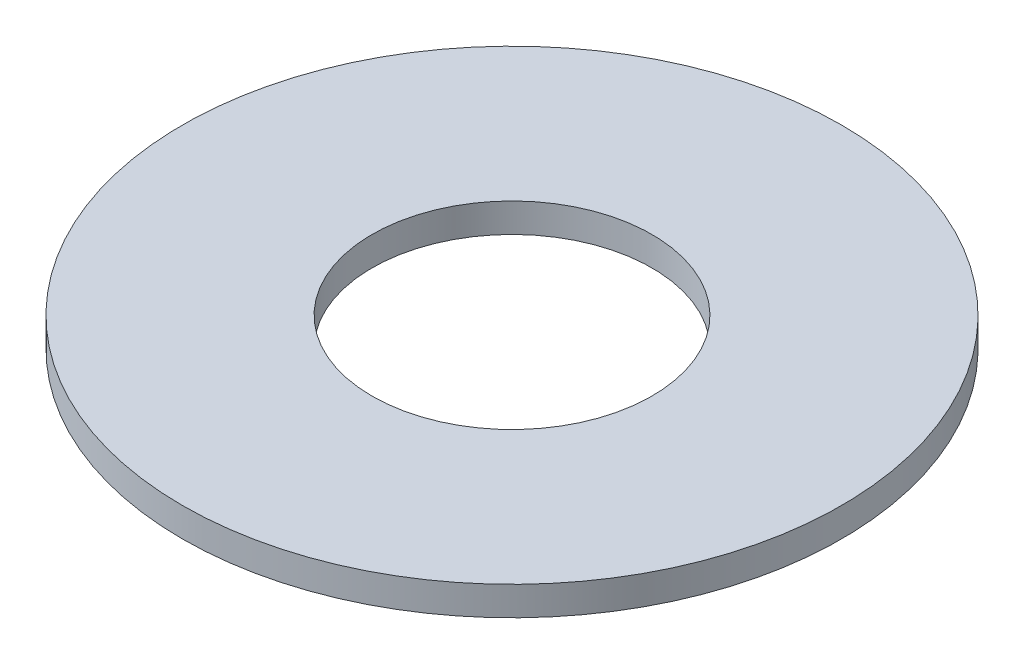
ISO-10303-21;
HEADER;
FILE_DESCRIPTION(('STEP AP214'),'2;1');
FILE_NAME('part.step','',(''),(''),'','','');
FILE_SCHEMA(('AUTOMOTIVE_DESIGN { 1 0 10303 214 1 1 1 1 }'));
ENDSEC;
DATA;
#1=APPLICATION_CONTEXT('core data for automotive mechanical design processes');
#2=APPLICATION_PROTOCOL_DEFINITION('international standard','automotive_design',2000,#1);
#3=PRODUCT_CONTEXT('',#1,'mechanical');
#4=PRODUCT('Part','Part','',(#3));
#5=PRODUCT_RELATED_PRODUCT_CATEGORY('part','',(#4));
#6=PRODUCT_DEFINITION_FORMATION('','',#4);
#7=PRODUCT_DEFINITION_CONTEXT('part definition',#1,'design');
#8=PRODUCT_DEFINITION('design','',#6,#7);
#9=PRODUCT_DEFINITION_SHAPE('','',#8);
#10=(LENGTH_UNIT() NAMED_UNIT(*) SI_UNIT(.MILLI.,.METRE.));
#11=(NAMED_UNIT(*) PLANE_ANGLE_UNIT() SI_UNIT($,.RADIAN.));
#12=(NAMED_UNIT(*) SI_UNIT($,.STERADIAN.) SOLID_ANGLE_UNIT());
#13=UNCERTAINTY_MEASURE_WITH_UNIT(LENGTH_MEASURE(1.E-05),#10,'distance_accuracy_value','');
#14=(GEOMETRIC_REPRESENTATION_CONTEXT(3) GLOBAL_UNCERTAINTY_ASSIGNED_CONTEXT((#13)) GLOBAL_UNIT_ASSIGNED_CONTEXT((#10,
#11,#12)) REPRESENTATION_CONTEXT('',''));
#15=CARTESIAN_POINT('',(0.,0.,0.));
#16=DIRECTION('',(0.,0.,1.));
#17=DIRECTION('',(1.,0.,0.));
#18=AXIS2_PLACEMENT_3D('',#15,#16,#17);
#19=CARTESIAN_POINT('',(0.,1.397,0.));
#20=DIRECTION('',(0.,-1.,0.));
#21=DIRECTION('',(0.,0.,-1.));
#22=AXIS2_PLACEMENT_3D('',#19,#20,#21);
#23=CYLINDRICAL_SURFACE('',#22,15.875);
#24=CARTESIAN_POINT('',(0.,1.397,0.));
#25=DIRECTION('',(0.,1.,0.));
#26=DIRECTION('',(0.,0.,1.));
#27=AXIS2_PLACEMENT_3D('',#24,#25,#26);
#28=CIRCLE('',#27,15.875);
#29=CARTESIAN_POINT('',(0.,1.397,15.875));
#30=VERTEX_POINT('',#29);
#31=EDGE_CURVE('E10',#30,#30,#28,.T.);
#32=ORIENTED_EDGE('',*,*,#31,.F.);
#33=EDGE_LOOP('',(#32));
#34=FACE_BOUND('',#33,.T.);
#35=CARTESIAN_POINT('',(0.,0.,0.));
#36=DIRECTION('',(0.,1.,0.));
#37=DIRECTION('',(0.,0.,1.));
#38=AXIS2_PLACEMENT_3D('',#35,#36,#37);
#39=CIRCLE('',#38,15.875);
#40=CARTESIAN_POINT('',(0.,0.,15.875));
#41=VERTEX_POINT('',#40);
#42=EDGE_CURVE('E38',#41,#41,#39,.T.);
#43=ORIENTED_EDGE('',*,*,#42,.T.);
#44=EDGE_LOOP('',(#43));
#45=FACE_BOUND('',#44,.T.);
#46=ADVANCED_FACE('F35',(#34,#45),#23,.T.);
#47=CARTESIAN_POINT('',(0.,1.397,0.));
#48=DIRECTION('',(0.,1.,0.));
#49=DIRECTION('',(0.,0.,1.));
#50=AXIS2_PLACEMENT_3D('',#47,#48,#49);
#51=PLANE('',#50);
#52=CARTESIAN_POINT('',(0.,1.397,0.));
#53=DIRECTION('',(0.,1.,0.));
#54=DIRECTION('',(0.,0.,1.));
#55=AXIS2_PLACEMENT_3D('',#52,#53,#54);
#56=CIRCLE('',#55,6.7437);
#57=CARTESIAN_POINT('',(0.,1.397,6.7437));
#58=VERTEX_POINT('',#57);
#59=EDGE_CURVE('E47',#58,#58,#56,.T.);
#60=ORIENTED_EDGE('',*,*,#59,.F.);
#61=EDGE_LOOP('',(#60));
#62=FACE_BOUND('',#61,.T.);
#63=ORIENTED_EDGE('',*,*,#31,.T.);
#64=EDGE_LOOP('',(#63));
#65=FACE_BOUND('',#64,.T.);
#66=ADVANCED_FACE('F62',(#62,#65),#51,.T.);
#67=CARTESIAN_POINT('',(0.,0.,0.));
#68=DIRECTION('',(0.,1.,0.));
#69=DIRECTION('',(0.,0.,1.));
#70=AXIS2_PLACEMENT_3D('',#67,#68,#69);
#71=PLANE('',#70);
#72=CARTESIAN_POINT('',(0.,0.,0.));
#73=DIRECTION('',(0.,1.,0.));
#74=DIRECTION('',(0.,0.,1.));
#75=AXIS2_PLACEMENT_3D('',#72,#73,#74);
#76=CIRCLE('',#75,6.7437);
#77=CARTESIAN_POINT('',(0.,0.,6.7437));
#78=VERTEX_POINT('',#77);
#79=EDGE_CURVE('E45',#78,#78,#76,.T.);
#80=ORIENTED_EDGE('',*,*,#79,.T.);
#81=EDGE_LOOP('',(#80));
#82=FACE_BOUND('',#81,.T.);
#83=ORIENTED_EDGE('',*,*,#42,.F.);
#84=EDGE_LOOP('',(#83));
#85=FACE_BOUND('',#84,.T.);
#86=ADVANCED_FACE('F53',(#82,#85),#71,.F.);
#87=CARTESIAN_POINT('',(0.,0.,0.));
#88=DIRECTION('',(0.,1.,0.));
#89=DIRECTION('',(0.,0.,1.));
#90=AXIS2_PLACEMENT_3D('',#87,#88,#89);
#91=CYLINDRICAL_SURFACE('',#90,6.7437);
#92=ORIENTED_EDGE('',*,*,#79,.F.);
#93=EDGE_LOOP('',(#92));
#94=FACE_BOUND('',#93,.T.);
#95=ORIENTED_EDGE('',*,*,#59,.T.);
#96=EDGE_LOOP('',(#95));
#97=FACE_BOUND('',#96,.T.);
#98=ADVANCED_FACE('F56',(#94,#97),#91,.F.);
#99=CLOSED_SHELL('',(#46,#66,#86,#98));
#100=MANIFOLD_SOLID_BREP('B2',#99);
#101=ADVANCED_BREP_SHAPE_REPRESENTATION('',(#18,#100),#14);
#102=SHAPE_DEFINITION_REPRESENTATION(#9,#101);
ENDSEC;
END-ISO-10303-21;
